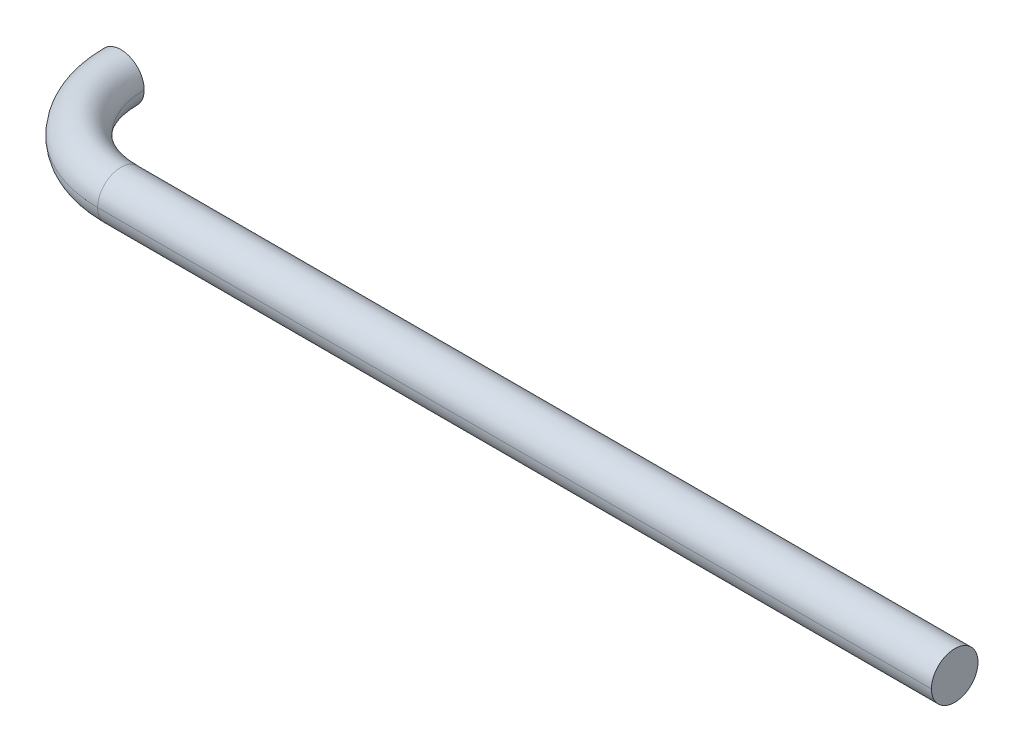
ISO-10303-21;
HEADER;
FILE_DESCRIPTION(('STEP AP214'),'2;1');
FILE_NAME('part.step','',(''),(''),'','','');
FILE_SCHEMA(('AUTOMOTIVE_DESIGN { 1 0 10303 214 1 1 1 1 }'));
ENDSEC;
DATA;
#1=APPLICATION_CONTEXT('core data for automotive mechanical design processes');
#2=APPLICATION_PROTOCOL_DEFINITION('international standard','automotive_design',2000,#1);
#3=PRODUCT_CONTEXT('',#1,'mechanical');
#4=PRODUCT('Part','Part','',(#3));
#5=PRODUCT_RELATED_PRODUCT_CATEGORY('part','',(#4));
#6=PRODUCT_DEFINITION_FORMATION('','',#4);
#7=PRODUCT_DEFINITION_CONTEXT('part definition',#1,'design');
#8=PRODUCT_DEFINITION('design','',#6,#7);
#9=PRODUCT_DEFINITION_SHAPE('','',#8);
#10=(LENGTH_UNIT() NAMED_UNIT(*) SI_UNIT(.MILLI.,.METRE.));
#11=(NAMED_UNIT(*) PLANE_ANGLE_UNIT() SI_UNIT($,.RADIAN.));
#12=(NAMED_UNIT(*) SI_UNIT($,.STERADIAN.) SOLID_ANGLE_UNIT());
#13=UNCERTAINTY_MEASURE_WITH_UNIT(LENGTH_MEASURE(1.E-05),#10,'distance_accuracy_value','');
#14=(GEOMETRIC_REPRESENTATION_CONTEXT(3) GLOBAL_UNCERTAINTY_ASSIGNED_CONTEXT((#13)) GLOBAL_UNIT_ASSIGNED_CONTEXT((#10,
#11,#12)) REPRESENTATION_CONTEXT('',''));
#15=CARTESIAN_POINT('',(0.,0.,0.));
#16=DIRECTION('',(0.,0.,1.));
#17=DIRECTION('',(1.,0.,0.));
#18=AXIS2_PLACEMENT_3D('',#15,#16,#17);
#19=CARTESIAN_POINT('',(3.4999999999986,0.,1.39727442019107E-12));
#20=DIRECTION('',(0.,1.,0.));
#21=DIRECTION('',(-1.,0.,-3.99221262911893E-13));
#22=AXIS2_PLACEMENT_3D('',#19,#20,#21);
#23=TOROIDAL_SURFACE('',#22,3.4999999999986,0.8);
#24=CARTESIAN_POINT('',(3.4999999999986,0.,1.39727442019107E-12));
#25=DIRECTION('',(0.,1.,0.));
#26=DIRECTION('',(0.,0.,1.));
#27=AXIS2_PLACEMENT_3D('',#24,#25,#26);
#28=CIRCLE('',#27,4.2999999999986);
#29=CARTESIAN_POINT('',(-0.8,0.,0.));
#30=VERTEX_POINT('',#29);
#31=CARTESIAN_POINT('',(3.49999999999744,0.,4.3));
#32=VERTEX_POINT('',#31);
#33=EDGE_CURVE('E72',#30,#32,#28,.T.);
#34=ORIENTED_EDGE('',*,*,#33,.F.);
#35=CARTESIAN_POINT('',(0.,0.,0.));
#36=DIRECTION('',(0.,0.,1.));
#37=DIRECTION('',(-1.,0.,0.));
#38=AXIS2_PLACEMENT_3D('',#35,#36,#37);
#39=CIRCLE('',#38,0.8);
#40=CARTESIAN_POINT('',(0.8,0.,0.));
#41=VERTEX_POINT('',#40);
#42=EDGE_CURVE('E28',#30,#41,#39,.T.);
#43=ORIENTED_EDGE('',*,*,#42,.T.);
#44=CARTESIAN_POINT('',(3.4999999999986,0.,1.39727442019107E-12));
#45=DIRECTION('',(0.,1.,0.));
#46=DIRECTION('',(0.,0.,1.));
#47=AXIS2_PLACEMENT_3D('',#44,#45,#46);
#48=CIRCLE('',#47,2.6999999999986);
#49=CARTESIAN_POINT('',(3.49999999999787,0.,2.7));
#50=VERTEX_POINT('',#49);
#51=EDGE_CURVE('E75',#41,#50,#48,.T.);
#52=ORIENTED_EDGE('',*,*,#51,.T.);
#53=CARTESIAN_POINT('',(3.49999999999765,0.,3.5));
#54=DIRECTION('',(1.,0.,2.71592644207619E-13));
#55=DIRECTION('',(-2.71592644207619E-13,0.,1.));
#56=AXIS2_PLACEMENT_3D('',#53,#54,#55);
#57=CIRCLE('',#56,0.8);
#58=EDGE_CURVE('E62',#32,#50,#57,.T.);
#59=ORIENTED_EDGE('',*,*,#58,.F.);
#60=EDGE_LOOP('',(#34,#43,#52,#59));
#61=FACE_BOUND('',#60,.T.);
#62=ADVANCED_FACE('F17',(#61),#23,.T.);
#63=CARTESIAN_POINT('',(3.49999999999765,0.,3.5));
#64=DIRECTION('',(1.,0.,0.));
#65=DIRECTION('',(0.,0.,1.));
#66=AXIS2_PLACEMENT_3D('',#63,#64,#65);
#67=CYLINDRICAL_SURFACE('',#66,0.8);
#68=DIRECTION('',(1.,0.,0.));
#69=VECTOR('',#68,1.);
#70=CARTESIAN_POINT('',(3.49999999999765,0.,2.7));
#71=LINE('',#70,#69);
#72=CARTESIAN_POINT('',(32.1389851691479,0.,2.7));
#73=VERTEX_POINT('',#72);
#74=EDGE_CURVE('E78',#50,#73,#71,.T.);
#75=ORIENTED_EDGE('',*,*,#74,.F.);
#76=CARTESIAN_POINT('',(3.49999999999765,0.,3.5));
#77=DIRECTION('',(1.,0.,2.71592644207619E-13));
#78=DIRECTION('',(-2.71592644207619E-13,0.,1.));
#79=AXIS2_PLACEMENT_3D('',#76,#77,#78);
#80=CIRCLE('',#79,0.8);
#81=EDGE_CURVE('E80',#50,#32,#80,.T.);
#82=ORIENTED_EDGE('',*,*,#81,.T.);
#83=DIRECTION('',(1.,0.,0.));
#84=VECTOR('',#83,1.);
#85=CARTESIAN_POINT('',(3.49999999999765,0.,4.3));
#86=LINE('',#85,#84);
#87=CARTESIAN_POINT('',(32.1389851691481,0.,4.3));
#88=VERTEX_POINT('',#87);
#89=EDGE_CURVE('E21',#32,#88,#86,.T.);
#90=ORIENTED_EDGE('',*,*,#89,.T.);
#91=CARTESIAN_POINT('',(32.138985169148,0.,3.5));
#92=DIRECTION('',(1.,0.,-1.3010426069826E-13));
#93=DIRECTION('',(1.3010426069826E-13,0.,1.));
#94=AXIS2_PLACEMENT_3D('',#91,#92,#93);
#95=CIRCLE('',#94,0.8);
#96=EDGE_CURVE('E11',#73,#88,#95,.T.);
#97=ORIENTED_EDGE('',*,*,#96,.F.);
#98=EDGE_LOOP('',(#75,#82,#90,#97));
#99=FACE_BOUND('',#98,.T.);
#100=ADVANCED_FACE('F19',(#99),#67,.T.);
#101=CARTESIAN_POINT('',(32.138985169148,0.,3.5));
#102=DIRECTION('',(1.,0.,-1.27491950812021E-13));
#103=DIRECTION('',(-1.27491950812021E-13,0.,-1.));
#104=AXIS2_PLACEMENT_3D('',#101,#102,#103);
#105=PLANE('',#104);
#106=CARTESIAN_POINT('',(32.138985169148,0.,3.5));
#107=DIRECTION('',(1.,0.,-1.3010426069826E-13));
#108=DIRECTION('',(1.3010426069826E-13,0.,1.));
#109=AXIS2_PLACEMENT_3D('',#106,#107,#108);
#110=CIRCLE('',#109,0.8);
#111=EDGE_CURVE('E64',#88,#73,#110,.T.);
#112=ORIENTED_EDGE('',*,*,#111,.T.);
#113=ORIENTED_EDGE('',*,*,#96,.T.);
#114=EDGE_LOOP('',(#112,#113));
#115=FACE_BOUND('',#114,.T.);
#116=ADVANCED_FACE('F146',(#115),#105,.T.);
#117=CARTESIAN_POINT('',(0.,0.,0.));
#118=DIRECTION('',(0.,0.,1.));
#119=DIRECTION('',(1.,0.,0.));
#120=AXIS2_PLACEMENT_3D('',#117,#118,#119);
#121=PLANE('',#120);
#122=CARTESIAN_POINT('',(0.,0.,0.));
#123=DIRECTION('',(0.,0.,1.));
#124=DIRECTION('',(-1.,0.,0.));
#125=AXIS2_PLACEMENT_3D('',#122,#123,#124);
#126=CIRCLE('',#125,0.8);
#127=EDGE_CURVE('E86',#41,#30,#126,.T.);
#128=ORIENTED_EDGE('',*,*,#127,.F.);
#129=ORIENTED_EDGE('',*,*,#42,.F.);
#130=EDGE_LOOP('',(#128,#129));
#131=FACE_BOUND('',#130,.T.);
#132=ADVANCED_FACE('F151',(#131),#121,.F.);
#133=CARTESIAN_POINT('',(3.49999999999765,0.,3.5));
#134=DIRECTION('',(1.,0.,0.));
#135=DIRECTION('',(0.,0.,1.));
#136=AXIS2_PLACEMENT_3D('',#133,#134,#135);
#137=CYLINDRICAL_SURFACE('',#136,0.8);
#138=ORIENTED_EDGE('',*,*,#58,.T.);
#139=ORIENTED_EDGE('',*,*,#74,.T.);
#140=ORIENTED_EDGE('',*,*,#111,.F.);
#141=ORIENTED_EDGE('',*,*,#89,.F.);
#142=EDGE_LOOP('',(#138,#139,#140,#141));
#143=FACE_BOUND('',#142,.T.);
#144=ADVANCED_FACE('F60',(#143),#137,.T.);
#145=CARTESIAN_POINT('',(3.4999999999986,0.,1.39727442019107E-12));
#146=DIRECTION('',(0.,1.,0.));
#147=DIRECTION('',(-1.,0.,-3.99221262911893E-13));
#148=AXIS2_PLACEMENT_3D('',#145,#146,#147);
#149=TOROIDAL_SURFACE('',#148,3.4999999999986,0.8);
#150=ORIENTED_EDGE('',*,*,#127,.T.);
#151=ORIENTED_EDGE('',*,*,#33,.T.);
#152=ORIENTED_EDGE('',*,*,#81,.F.);
#153=ORIENTED_EDGE('',*,*,#51,.F.);
#154=EDGE_LOOP('',(#150,#151,#152,#153));
#155=FACE_BOUND('',#154,.T.);
#156=ADVANCED_FACE('F84',(#155),#149,.T.);
#157=CLOSED_SHELL('',(#62,#100,#116,#132,#144,#156));
#158=MANIFOLD_SOLID_BREP('B1',#157);
#159=ADVANCED_BREP_SHAPE_REPRESENTATION('',(#18,#158),#14);
#160=SHAPE_DEFINITION_REPRESENTATION(#9,#159);
ENDSEC;
END-ISO-10303-21;
